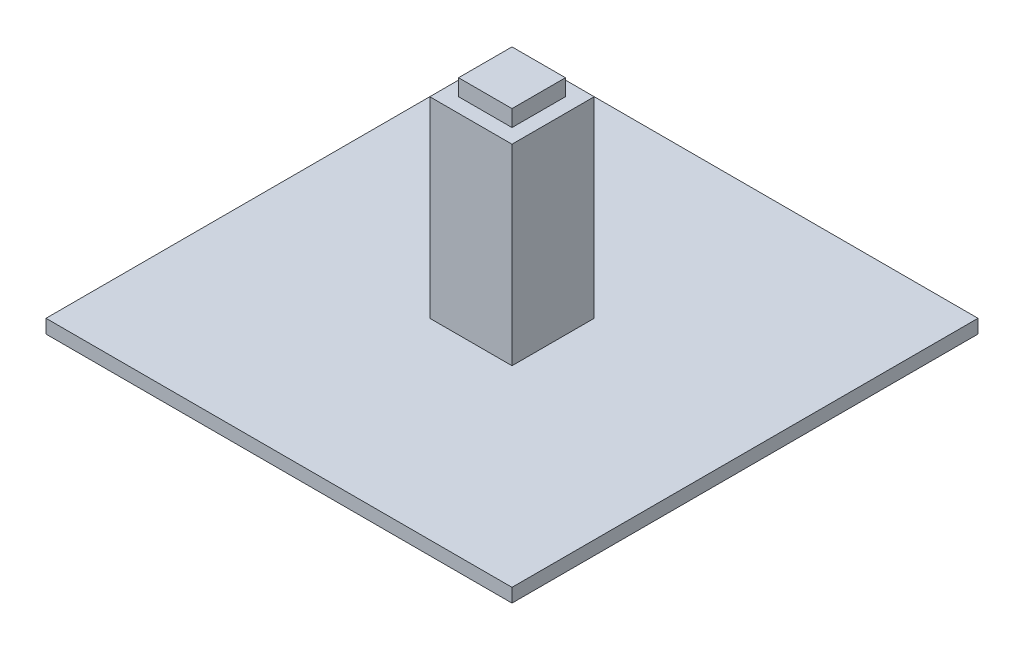
ISO-10303-21;
HEADER;
FILE_DESCRIPTION(('STEP AP214'),'2;1');
FILE_NAME('part.step','',(''),(''),'','','');
FILE_SCHEMA(('AUTOMOTIVE_DESIGN { 1 0 10303 214 1 1 1 1 }'));
ENDSEC;
DATA;
#1=APPLICATION_CONTEXT('core data for automotive mechanical design processes');
#2=APPLICATION_PROTOCOL_DEFINITION('international standard','automotive_design',2000,#1);
#3=PRODUCT_CONTEXT('',#1,'mechanical');
#4=PRODUCT('Part','Part','',(#3));
#5=PRODUCT_RELATED_PRODUCT_CATEGORY('part','',(#4));
#6=PRODUCT_DEFINITION_FORMATION('','',#4);
#7=PRODUCT_DEFINITION_CONTEXT('part definition',#1,'design');
#8=PRODUCT_DEFINITION('design','',#6,#7);
#9=PRODUCT_DEFINITION_SHAPE('','',#8);
#10=(LENGTH_UNIT() NAMED_UNIT(*) SI_UNIT(.MILLI.,.METRE.));
#11=(NAMED_UNIT(*) PLANE_ANGLE_UNIT() SI_UNIT($,.RADIAN.));
#12=(NAMED_UNIT(*) SI_UNIT($,.STERADIAN.) SOLID_ANGLE_UNIT());
#13=UNCERTAINTY_MEASURE_WITH_UNIT(LENGTH_MEASURE(1.E-05),#10,'distance_accuracy_value','');
#14=(GEOMETRIC_REPRESENTATION_CONTEXT(3) GLOBAL_UNCERTAINTY_ASSIGNED_CONTEXT((#13)) GLOBAL_UNIT_ASSIGNED_CONTEXT((#10,
#11,#12)) REPRESENTATION_CONTEXT('',''));
#15=CARTESIAN_POINT('',(0.,0.,0.));
#16=DIRECTION('',(0.,0.,1.));
#17=DIRECTION('',(1.,0.,0.));
#18=AXIS2_PLACEMENT_3D('',#15,#16,#17);
#19=CARTESIAN_POINT('',(0.,75.,0.));
#20=DIRECTION('',(0.,-1.,0.));
#21=DIRECTION('',(0.,0.,-1.));
#22=AXIS2_PLACEMENT_3D('',#19,#20,#21);
#23=PLANE('',#22);
#24=DIRECTION('',(0.,0.,-1.));
#25=VECTOR('',#24,1.);
#26=CARTESIAN_POINT('',(15.,75.,15.));
#27=LINE('',#26,#25);
#28=CARTESIAN_POINT('',(15.,75.,15.));
#29=VERTEX_POINT('',#28);
#30=CARTESIAN_POINT('',(15.,75.,-15.));
#31=VERTEX_POINT('',#30);
#32=EDGE_CURVE('E163',#29,#31,#27,.T.);
#33=ORIENTED_EDGE('',*,*,#32,.T.);
#34=DIRECTION('',(-1.,0.,0.));
#35=VECTOR('',#34,1.);
#36=CARTESIAN_POINT('',(-15.,75.,-15.));
#37=LINE('',#36,#35);
#38=CARTESIAN_POINT('',(-15.,75.,-15.));
#39=VERTEX_POINT('',#38);
#40=EDGE_CURVE('E167',#31,#39,#37,.T.);
#41=ORIENTED_EDGE('',*,*,#40,.T.);
#42=DIRECTION('',(0.,0.,1.));
#43=VECTOR('',#42,1.);
#44=CARTESIAN_POINT('',(-15.,75.,15.));
#45=LINE('',#44,#43);
#46=CARTESIAN_POINT('',(-15.,75.,15.));
#47=VERTEX_POINT('',#46);
#48=EDGE_CURVE('E171',#39,#47,#45,.T.);
#49=ORIENTED_EDGE('',*,*,#48,.T.);
#50=DIRECTION('',(1.,0.,0.));
#51=VECTOR('',#50,1.);
#52=CARTESIAN_POINT('',(-15.,75.,15.));
#53=LINE('',#52,#51);
#54=EDGE_CURVE('E174',#47,#29,#53,.T.);
#55=ORIENTED_EDGE('',*,*,#54,.T.);
#56=EDGE_LOOP('',(#33,#41,#49,#55));
#57=FACE_BOUND('',#56,.T.);
#58=DIRECTION('',(0.,0.,-1.));
#59=VECTOR('',#58,1.);
#60=CARTESIAN_POINT('',(9.75,75.,9.75));
#61=LINE('',#60,#59);
#62=CARTESIAN_POINT('',(9.75,75.,9.75));
#63=VERTEX_POINT('',#62);
#64=CARTESIAN_POINT('',(9.75,75.,-9.75));
#65=VERTEX_POINT('',#64);
#66=EDGE_CURVE('E55',#63,#65,#61,.T.);
#67=ORIENTED_EDGE('',*,*,#66,.F.);
#68=DIRECTION('',(1.,0.,0.));
#69=VECTOR('',#68,1.);
#70=CARTESIAN_POINT('',(-9.75,75.,9.75));
#71=LINE('',#70,#69);
#72=CARTESIAN_POINT('',(-9.75,75.,9.75));
#73=VERTEX_POINT('',#72);
#74=EDGE_CURVE('E59',#73,#63,#71,.T.);
#75=ORIENTED_EDGE('',*,*,#74,.F.);
#76=DIRECTION('',(0.,0.,1.));
#77=VECTOR('',#76,1.);
#78=CARTESIAN_POINT('',(-9.75,75.,9.75));
#79=LINE('',#78,#77);
#80=CARTESIAN_POINT('',(-9.75,75.,-9.75));
#81=VERTEX_POINT('',#80);
#82=EDGE_CURVE('E403',#81,#73,#79,.T.);
#83=ORIENTED_EDGE('',*,*,#82,.F.);
#84=DIRECTION('',(-1.,0.,0.));
#85=VECTOR('',#84,1.);
#86=CARTESIAN_POINT('',(-9.75,75.,-9.75));
#87=LINE('',#86,#85);
#88=EDGE_CURVE('E413',#65,#81,#87,.T.);
#89=ORIENTED_EDGE('',*,*,#88,.F.);
#90=EDGE_LOOP('',(#67,#75,#83,#89));
#91=FACE_BOUND('',#90,.T.);
#92=ADVANCED_FACE('F39',(#57,#91),#23,.F.);
#93=CARTESIAN_POINT('',(0.,5.,0.));
#94=DIRECTION('',(0.,-1.,0.));
#95=DIRECTION('',(0.,0.,-1.));
#96=AXIS2_PLACEMENT_3D('',#93,#94,#95);
#97=PLANE('',#96);
#98=DIRECTION('',(0.,0.,-1.));
#99=VECTOR('',#98,1.);
#100=CARTESIAN_POINT('',(85.,5.,85.));
#101=LINE('',#100,#99);
#102=CARTESIAN_POINT('',(85.,5.,85.));
#103=VERTEX_POINT('',#102);
#104=CARTESIAN_POINT('',(85.,5.,-85.));
#105=VERTEX_POINT('',#104);
#106=EDGE_CURVE('E204',#103,#105,#101,.T.);
#107=ORIENTED_EDGE('',*,*,#106,.T.);
#108=DIRECTION('',(-1.,0.,0.));
#109=VECTOR('',#108,1.);
#110=CARTESIAN_POINT('',(-85.,5.,-85.));
#111=LINE('',#110,#109);
#112=CARTESIAN_POINT('',(-85.,5.,-85.));
#113=VERTEX_POINT('',#112);
#114=EDGE_CURVE('E208',#105,#113,#111,.T.);
#115=ORIENTED_EDGE('',*,*,#114,.T.);
#116=DIRECTION('',(0.,0.,1.));
#117=VECTOR('',#116,1.);
#118=CARTESIAN_POINT('',(-85.,5.,85.));
#119=LINE('',#118,#117);
#120=CARTESIAN_POINT('',(-85.,5.,85.));
#121=VERTEX_POINT('',#120);
#122=EDGE_CURVE('E212',#113,#121,#119,.T.);
#123=ORIENTED_EDGE('',*,*,#122,.T.);
#124=DIRECTION('',(1.,0.,0.));
#125=VECTOR('',#124,1.);
#126=CARTESIAN_POINT('',(-85.,5.,85.));
#127=LINE('',#126,#125);
#128=EDGE_CURVE('E215',#121,#103,#127,.T.);
#129=ORIENTED_EDGE('',*,*,#128,.T.);
#130=EDGE_LOOP('',(#107,#115,#123,#129));
#131=FACE_BOUND('',#130,.T.);
#132=DIRECTION('',(0.,0.,-1.));
#133=VECTOR('',#132,1.);
#134=CARTESIAN_POINT('',(15.,5.,15.));
#135=LINE('',#134,#133);
#136=CARTESIAN_POINT('',(15.,5.,15.));
#137=VERTEX_POINT('',#136);
#138=CARTESIAN_POINT('',(15.,5.,-15.));
#139=VERTEX_POINT('',#138);
#140=EDGE_CURVE('E152',#137,#139,#135,.T.);
#141=ORIENTED_EDGE('',*,*,#140,.F.);
#142=DIRECTION('',(1.,0.,0.));
#143=VECTOR('',#142,1.);
#144=CARTESIAN_POINT('',(-15.,5.,15.));
#145=LINE('',#144,#143);
#146=CARTESIAN_POINT('',(-15.,5.,15.));
#147=VERTEX_POINT('',#146);
#148=EDGE_CURVE('E168',#147,#137,#145,.T.);
#149=ORIENTED_EDGE('',*,*,#148,.F.);
#150=DIRECTION('',(0.,0.,1.));
#151=VECTOR('',#150,1.);
#152=CARTESIAN_POINT('',(-15.,5.,15.));
#153=LINE('',#152,#151);
#154=CARTESIAN_POINT('',(-15.,5.,-15.));
#155=VERTEX_POINT('',#154);
#156=EDGE_CURVE('E181',#155,#147,#153,.T.);
#157=ORIENTED_EDGE('',*,*,#156,.F.);
#158=DIRECTION('',(-1.,0.,0.));
#159=VECTOR('',#158,1.);
#160=CARTESIAN_POINT('',(-15.,5.,-15.));
#161=LINE('',#160,#159);
#162=EDGE_CURVE('E157',#139,#155,#161,.T.);
#163=ORIENTED_EDGE('',*,*,#162,.F.);
#164=EDGE_LOOP('',(#141,#149,#157,#163));
#165=FACE_BOUND('',#164,.T.);
#166=ADVANCED_FACE('F257',(#131,#165),#97,.F.);
#167=CARTESIAN_POINT('',(85.,5.,85.));
#168=DIRECTION('',(-1.,0.,0.));
#169=DIRECTION('',(0.,0.,1.));
#170=AXIS2_PLACEMENT_3D('',#167,#168,#169);
#171=PLANE('',#170);
#172=DIRECTION('',(0.,0.,-1.));
#173=VECTOR('',#172,1.);
#174=CARTESIAN_POINT('',(85.,0.,85.));
#175=LINE('',#174,#173);
#176=CARTESIAN_POINT('',(85.,0.,85.));
#177=VERTEX_POINT('',#176);
#178=CARTESIAN_POINT('',(85.,0.,-85.));
#179=VERTEX_POINT('',#178);
#180=EDGE_CURVE('E203',#177,#179,#175,.T.);
#181=ORIENTED_EDGE('',*,*,#180,.T.);
#182=DIRECTION('',(0.,-1.,0.));
#183=VECTOR('',#182,1.);
#184=CARTESIAN_POINT('',(85.,5.,-85.));
#185=LINE('',#184,#183);
#186=EDGE_CURVE('E11',#105,#179,#185,.T.);
#187=ORIENTED_EDGE('',*,*,#186,.F.);
#188=ORIENTED_EDGE('',*,*,#106,.F.);
#189=DIRECTION('',(0.,-1.,0.));
#190=VECTOR('',#189,1.);
#191=CARTESIAN_POINT('',(85.,5.,85.));
#192=LINE('',#191,#190);
#193=EDGE_CURVE('E218',#103,#177,#192,.T.);
#194=ORIENTED_EDGE('',*,*,#193,.T.);
#195=EDGE_LOOP('',(#181,#187,#188,#194));
#196=FACE_BOUND('',#195,.T.);
#197=ADVANCED_FACE('F41',(#196),#171,.F.);
#198=CARTESIAN_POINT('',(-85.,5.,-85.));
#199=DIRECTION('',(0.,0.,1.));
#200=DIRECTION('',(1.,0.,0.));
#201=AXIS2_PLACEMENT_3D('',#198,#199,#200);
#202=PLANE('',#201);
#203=DIRECTION('',(-1.,0.,0.));
#204=VECTOR('',#203,1.);
#205=CARTESIAN_POINT('',(-85.,0.,-85.));
#206=LINE('',#205,#204);
#207=CARTESIAN_POINT('',(-85.,0.,-85.));
#208=VERTEX_POINT('',#207);
#209=EDGE_CURVE('E222',#179,#208,#206,.T.);
#210=ORIENTED_EDGE('',*,*,#209,.T.);
#211=DIRECTION('',(0.,-1.,0.));
#212=VECTOR('',#211,1.);
#213=CARTESIAN_POINT('',(-85.,5.,-85.));
#214=LINE('',#213,#212);
#215=EDGE_CURVE('E48',#113,#208,#214,.T.);
#216=ORIENTED_EDGE('',*,*,#215,.F.);
#217=ORIENTED_EDGE('',*,*,#114,.F.);
#218=ORIENTED_EDGE('',*,*,#186,.T.);
#219=EDGE_LOOP('',(#210,#216,#217,#218));
#220=FACE_BOUND('',#219,.T.);
#221=ADVANCED_FACE('F259',(#220),#202,.F.);
#222=CARTESIAN_POINT('',(-85.,5.,85.));
#223=DIRECTION('',(1.,0.,0.));
#224=DIRECTION('',(0.,0.,-1.));
#225=AXIS2_PLACEMENT_3D('',#222,#223,#224);
#226=PLANE('',#225);
#227=DIRECTION('',(0.,0.,1.));
#228=VECTOR('',#227,1.);
#229=CARTESIAN_POINT('',(-85.,0.,85.));
#230=LINE('',#229,#228);
#231=CARTESIAN_POINT('',(-85.,0.,85.));
#232=VERTEX_POINT('',#231);
#233=EDGE_CURVE('E225',#208,#232,#230,.T.);
#234=ORIENTED_EDGE('',*,*,#233,.T.);
#235=DIRECTION('',(0.,-1.,0.));
#236=VECTOR('',#235,1.);
#237=CARTESIAN_POINT('',(-85.,5.,85.));
#238=LINE('',#237,#236);
#239=EDGE_CURVE('E233',#121,#232,#238,.T.);
#240=ORIENTED_EDGE('',*,*,#239,.F.);
#241=ORIENTED_EDGE('',*,*,#122,.F.);
#242=ORIENTED_EDGE('',*,*,#215,.T.);
#243=EDGE_LOOP('',(#234,#240,#241,#242));
#244=FACE_BOUND('',#243,.T.);
#245=ADVANCED_FACE('F242',(#244),#226,.F.);
#246=CARTESIAN_POINT('',(-85.,5.,85.));
#247=DIRECTION('',(0.,0.,-1.));
#248=DIRECTION('',(-1.,0.,0.));
#249=AXIS2_PLACEMENT_3D('',#246,#247,#248);
#250=PLANE('',#249);
#251=DIRECTION('',(1.,0.,0.));
#252=VECTOR('',#251,1.);
#253=CARTESIAN_POINT('',(-85.,0.,85.));
#254=LINE('',#253,#252);
#255=EDGE_CURVE('E209',#232,#177,#254,.T.);
#256=ORIENTED_EDGE('',*,*,#255,.T.);
#257=ORIENTED_EDGE('',*,*,#193,.F.);
#258=ORIENTED_EDGE('',*,*,#128,.F.);
#259=ORIENTED_EDGE('',*,*,#239,.T.);
#260=EDGE_LOOP('',(#256,#257,#258,#259));
#261=FACE_BOUND('',#260,.T.);
#262=ADVANCED_FACE('F251',(#261),#250,.F.);
#263=CARTESIAN_POINT('',(0.,0.,0.));
#264=DIRECTION('',(0.,-1.,0.));
#265=DIRECTION('',(0.,0.,-1.));
#266=AXIS2_PLACEMENT_3D('',#263,#264,#265);
#267=PLANE('',#266);
#268=ORIENTED_EDGE('',*,*,#180,.F.);
#269=ORIENTED_EDGE('',*,*,#255,.F.);
#270=ORIENTED_EDGE('',*,*,#233,.F.);
#271=ORIENTED_EDGE('',*,*,#209,.F.);
#272=EDGE_LOOP('',(#268,#269,#270,#271));
#273=FACE_BOUND('',#272,.T.);
#274=ADVANCED_FACE('F248',(#273),#267,.T.);
#275=CARTESIAN_POINT('',(15.,75.,15.));
#276=DIRECTION('',(-1.,0.,0.));
#277=DIRECTION('',(0.,0.,1.));
#278=AXIS2_PLACEMENT_3D('',#275,#276,#277);
#279=PLANE('',#278);
#280=ORIENTED_EDGE('',*,*,#140,.T.);
#281=DIRECTION('',(0.,-1.,0.));
#282=VECTOR('',#281,1.);
#283=CARTESIAN_POINT('',(15.,75.,-15.));
#284=LINE('',#283,#282);
#285=EDGE_CURVE('E199',#31,#139,#284,.T.);
#286=ORIENTED_EDGE('',*,*,#285,.F.);
#287=ORIENTED_EDGE('',*,*,#32,.F.);
#288=DIRECTION('',(0.,-1.,0.));
#289=VECTOR('',#288,1.);
#290=CARTESIAN_POINT('',(15.,75.,15.));
#291=LINE('',#290,#289);
#292=EDGE_CURVE('E176',#29,#137,#291,.T.);
#293=ORIENTED_EDGE('',*,*,#292,.T.);
#294=EDGE_LOOP('',(#280,#286,#287,#293));
#295=FACE_BOUND('',#294,.T.);
#296=ADVANCED_FACE('F287',(#295),#279,.F.);
#297=CARTESIAN_POINT('',(-15.,75.,-15.));
#298=DIRECTION('',(0.,0.,1.));
#299=DIRECTION('',(1.,0.,0.));
#300=AXIS2_PLACEMENT_3D('',#297,#298,#299);
#301=PLANE('',#300);
#302=ORIENTED_EDGE('',*,*,#162,.T.);
#303=DIRECTION('',(0.,-1.,0.));
#304=VECTOR('',#303,1.);
#305=CARTESIAN_POINT('',(-15.,75.,-15.));
#306=LINE('',#305,#304);
#307=EDGE_CURVE('E195',#39,#155,#306,.T.);
#308=ORIENTED_EDGE('',*,*,#307,.F.);
#309=ORIENTED_EDGE('',*,*,#40,.F.);
#310=ORIENTED_EDGE('',*,*,#285,.T.);
#311=EDGE_LOOP('',(#302,#308,#309,#310));
#312=FACE_BOUND('',#311,.T.);
#313=ADVANCED_FACE('F283',(#312),#301,.F.);
#314=CARTESIAN_POINT('',(-15.,75.,15.));
#315=DIRECTION('',(1.,0.,0.));
#316=DIRECTION('',(0.,0.,-1.));
#317=AXIS2_PLACEMENT_3D('',#314,#315,#316);
#318=PLANE('',#317);
#319=ORIENTED_EDGE('',*,*,#156,.T.);
#320=DIRECTION('',(0.,-1.,0.));
#321=VECTOR('',#320,1.);
#322=CARTESIAN_POINT('',(-15.,75.,15.));
#323=LINE('',#322,#321);
#324=EDGE_CURVE('E191',#47,#147,#323,.T.);
#325=ORIENTED_EDGE('',*,*,#324,.F.);
#326=ORIENTED_EDGE('',*,*,#48,.F.);
#327=ORIENTED_EDGE('',*,*,#307,.T.);
#328=EDGE_LOOP('',(#319,#325,#326,#327));
#329=FACE_BOUND('',#328,.T.);
#330=ADVANCED_FACE('F279',(#329),#318,.F.);
#331=CARTESIAN_POINT('',(-15.,75.,15.));
#332=DIRECTION('',(0.,0.,-1.));
#333=DIRECTION('',(-1.,0.,0.));
#334=AXIS2_PLACEMENT_3D('',#331,#332,#333);
#335=PLANE('',#334);
#336=ORIENTED_EDGE('',*,*,#148,.T.);
#337=ORIENTED_EDGE('',*,*,#292,.F.);
#338=ORIENTED_EDGE('',*,*,#54,.F.);
#339=ORIENTED_EDGE('',*,*,#324,.T.);
#340=EDGE_LOOP('',(#336,#337,#338,#339));
#341=FACE_BOUND('',#340,.T.);
#342=ADVANCED_FACE('F276',(#341),#335,.F.);
#343=CARTESIAN_POINT('',(9.75,81.,9.75));
#344=DIRECTION('',(-1.,0.,0.));
#345=DIRECTION('',(0.,0.,1.));
#346=AXIS2_PLACEMENT_3D('',#343,#344,#345);
#347=PLANE('',#346);
#348=ORIENTED_EDGE('',*,*,#66,.T.);
#349=DIRECTION('',(0.,-1.,0.));
#350=VECTOR('',#349,1.);
#351=CARTESIAN_POINT('',(9.75,81.,-9.75));
#352=LINE('',#351,#350);
#353=CARTESIAN_POINT('',(9.75,81.,-9.75));
#354=VERTEX_POINT('',#353);
#355=EDGE_CURVE('E132',#354,#65,#352,.T.);
#356=ORIENTED_EDGE('',*,*,#355,.F.);
#357=DIRECTION('',(0.,0.,-1.));
#358=VECTOR('',#357,1.);
#359=CARTESIAN_POINT('',(9.75,81.,9.75));
#360=LINE('',#359,#358);
#361=CARTESIAN_POINT('',(9.75,81.,9.75));
#362=VERTEX_POINT('',#361);
#363=EDGE_CURVE('E139',#362,#354,#360,.T.);
#364=ORIENTED_EDGE('',*,*,#363,.F.);
#365=DIRECTION('',(0.,-1.,0.));
#366=VECTOR('',#365,1.);
#367=CARTESIAN_POINT('',(9.75,81.,9.75));
#368=LINE('',#367,#366);
#369=EDGE_CURVE('E400',#362,#63,#368,.T.);
#370=ORIENTED_EDGE('',*,*,#369,.T.);
#371=EDGE_LOOP('',(#348,#356,#364,#370));
#372=FACE_BOUND('',#371,.T.);
#373=ADVANCED_FACE('F150',(#372),#347,.F.);
#374=CARTESIAN_POINT('',(-9.75,81.,-9.75));
#375=DIRECTION('',(0.,0.,1.));
#376=DIRECTION('',(1.,0.,0.));
#377=AXIS2_PLACEMENT_3D('',#374,#375,#376);
#378=PLANE('',#377);
#379=ORIENTED_EDGE('',*,*,#88,.T.);
#380=DIRECTION('',(0.,-1.,0.));
#381=VECTOR('',#380,1.);
#382=CARTESIAN_POINT('',(-9.75,81.,-9.75));
#383=LINE('',#382,#381);
#384=CARTESIAN_POINT('',(-9.75,81.,-9.75));
#385=VERTEX_POINT('',#384);
#386=EDGE_CURVE('E134',#385,#81,#383,.T.);
#387=ORIENTED_EDGE('',*,*,#386,.F.);
#388=DIRECTION('',(-1.,0.,0.));
#389=VECTOR('',#388,1.);
#390=CARTESIAN_POINT('',(-9.75,81.,-9.75));
#391=LINE('',#390,#389);
#392=EDGE_CURVE('E127',#354,#385,#391,.T.);
#393=ORIENTED_EDGE('',*,*,#392,.F.);
#394=ORIENTED_EDGE('',*,*,#355,.T.);
#395=EDGE_LOOP('',(#379,#387,#393,#394));
#396=FACE_BOUND('',#395,.T.);
#397=ADVANCED_FACE('F130',(#396),#378,.F.);
#398=CARTESIAN_POINT('',(-9.75,81.,9.75));
#399=DIRECTION('',(1.,0.,0.));
#400=DIRECTION('',(0.,0.,-1.));
#401=AXIS2_PLACEMENT_3D('',#398,#399,#400);
#402=PLANE('',#401);
#403=ORIENTED_EDGE('',*,*,#82,.T.);
#404=DIRECTION('',(0.,-1.,0.));
#405=VECTOR('',#404,1.);
#406=CARTESIAN_POINT('',(-9.75,81.,9.75));
#407=LINE('',#406,#405);
#408=CARTESIAN_POINT('',(-9.75,81.,9.75));
#409=VERTEX_POINT('',#408);
#410=EDGE_CURVE('E159',#409,#73,#407,.T.);
#411=ORIENTED_EDGE('',*,*,#410,.F.);
#412=DIRECTION('',(0.,0.,1.));
#413=VECTOR('',#412,1.);
#414=CARTESIAN_POINT('',(-9.75,81.,9.75));
#415=LINE('',#414,#413);
#416=EDGE_CURVE('E138',#385,#409,#415,.T.);
#417=ORIENTED_EDGE('',*,*,#416,.F.);
#418=ORIENTED_EDGE('',*,*,#386,.T.);
#419=EDGE_LOOP('',(#403,#411,#417,#418));
#420=FACE_BOUND('',#419,.T.);
#421=ADVANCED_FACE('F331',(#420),#402,.F.);
#422=CARTESIAN_POINT('',(-9.75,81.,9.75));
#423=DIRECTION('',(0.,0.,-1.));
#424=DIRECTION('',(-1.,0.,0.));
#425=AXIS2_PLACEMENT_3D('',#422,#423,#424);
#426=PLANE('',#425);
#427=ORIENTED_EDGE('',*,*,#74,.T.);
#428=ORIENTED_EDGE('',*,*,#369,.F.);
#429=DIRECTION('',(1.,0.,0.));
#430=VECTOR('',#429,1.);
#431=CARTESIAN_POINT('',(-9.75,81.,9.75));
#432=LINE('',#431,#430);
#433=EDGE_CURVE('E144',#409,#362,#432,.T.);
#434=ORIENTED_EDGE('',*,*,#433,.F.);
#435=ORIENTED_EDGE('',*,*,#410,.T.);
#436=EDGE_LOOP('',(#427,#428,#434,#435));
#437=FACE_BOUND('',#436,.T.);
#438=ADVANCED_FACE('F337',(#437),#426,.F.);
#439=CARTESIAN_POINT('',(0.,81.,0.));
#440=DIRECTION('',(0.,-1.,0.));
#441=DIRECTION('',(0.,0.,-1.));
#442=AXIS2_PLACEMENT_3D('',#439,#440,#441);
#443=PLANE('',#442);
#444=ORIENTED_EDGE('',*,*,#363,.T.);
#445=ORIENTED_EDGE('',*,*,#392,.T.);
#446=ORIENTED_EDGE('',*,*,#416,.T.);
#447=ORIENTED_EDGE('',*,*,#433,.T.);
#448=EDGE_LOOP('',(#444,#445,#446,#447));
#449=FACE_BOUND('',#448,.T.);
#450=ADVANCED_FACE('F142',(#449),#443,.F.);
#451=CLOSED_SHELL('',(#92,#166,#197,#221,#245,#262,#274,#296,#313,#330,#342,#373,#397,#421,#438,#450));
#452=MANIFOLD_SOLID_BREP('B2',#451);
#453=ADVANCED_BREP_SHAPE_REPRESENTATION('',(#18,#452),#14);
#454=SHAPE_DEFINITION_REPRESENTATION(#9,#453);
ENDSEC;
END-ISO-10303-21;
